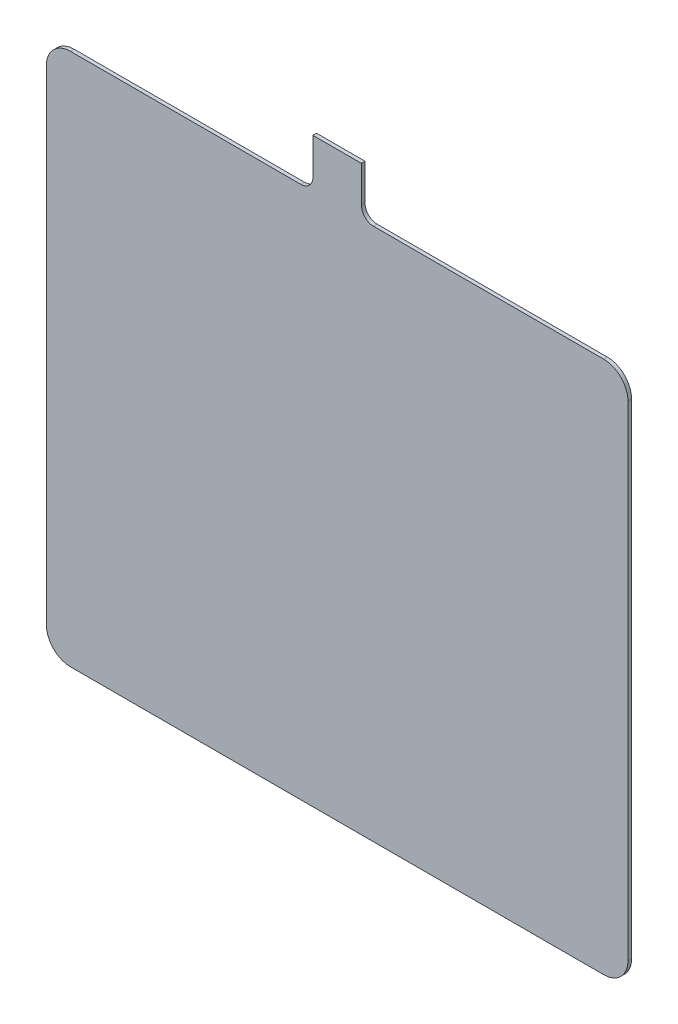
ISO-10303-21;
HEADER;
FILE_DESCRIPTION(('STEP AP214'),'2;1');
FILE_NAME('part.step','',(''),(''),'','','');
FILE_SCHEMA(('AUTOMOTIVE_DESIGN { 1 0 10303 214 1 1 1 1 }'));
ENDSEC;
DATA;
#1=APPLICATION_CONTEXT('core data for automotive mechanical design processes');
#2=APPLICATION_PROTOCOL_DEFINITION('international standard','automotive_design',2000,#1);
#3=PRODUCT_CONTEXT('',#1,'mechanical');
#4=PRODUCT('Part','Part','',(#3));
#5=PRODUCT_RELATED_PRODUCT_CATEGORY('part','',(#4));
#6=PRODUCT_DEFINITION_FORMATION('','',#4);
#7=PRODUCT_DEFINITION_CONTEXT('part definition',#1,'design');
#8=PRODUCT_DEFINITION('design','',#6,#7);
#9=PRODUCT_DEFINITION_SHAPE('','',#8);
#10=(LENGTH_UNIT() NAMED_UNIT(*) SI_UNIT(.MILLI.,.METRE.));
#11=(NAMED_UNIT(*) PLANE_ANGLE_UNIT() SI_UNIT($,.RADIAN.));
#12=(NAMED_UNIT(*) SI_UNIT($,.STERADIAN.) SOLID_ANGLE_UNIT());
#13=UNCERTAINTY_MEASURE_WITH_UNIT(LENGTH_MEASURE(1.E-05),#10,'distance_accuracy_value','');
#14=(GEOMETRIC_REPRESENTATION_CONTEXT(3) GLOBAL_UNCERTAINTY_ASSIGNED_CONTEXT((#13)) GLOBAL_UNIT_ASSIGNED_CONTEXT((#10,
#11,#12)) REPRESENTATION_CONTEXT('',''));
#15=CARTESIAN_POINT('',(0.,0.,0.));
#16=DIRECTION('',(0.,0.,1.));
#17=DIRECTION('',(1.,0.,0.));
#18=AXIS2_PLACEMENT_3D('',#15,#16,#17);
#19=CARTESIAN_POINT('',(-30.,305.,3.));
#20=DIRECTION('',(0.,0.,-1.));
#21=DIRECTION('',(-1.,0.,0.));
#22=AXIS2_PLACEMENT_3D('',#19,#20,#21);
#23=CYLINDRICAL_SURFACE('',#22,10.);
#24=CARTESIAN_POINT('',(-30.,305.,0.));
#25=DIRECTION('',(0.,0.,-1.));
#26=DIRECTION('',(1.,0.,0.));
#27=AXIS2_PLACEMENT_3D('',#24,#25,#26);
#28=CIRCLE('',#27,10.);
#29=CARTESIAN_POINT('',(-20.,305.,0.));
#30=VERTEX_POINT('',#29);
#31=CARTESIAN_POINT('',(-30.,295.,0.));
#32=VERTEX_POINT('',#31);
#33=EDGE_CURVE('E165',#30,#32,#28,.T.);
#34=ORIENTED_EDGE('',*,*,#33,.T.);
#35=DIRECTION('',(0.,0.,-1.));
#36=VECTOR('',#35,1.);
#37=CARTESIAN_POINT('',(-30.,295.,3.));
#38=LINE('',#37,#36);
#39=CARTESIAN_POINT('',(-30.,295.,3.));
#40=VERTEX_POINT('',#39);
#41=EDGE_CURVE('E11',#40,#32,#38,.T.);
#42=ORIENTED_EDGE('',*,*,#41,.F.);
#43=CARTESIAN_POINT('',(-30.,305.,3.));
#44=DIRECTION('',(0.,0.,-1.));
#45=DIRECTION('',(1.,0.,0.));
#46=AXIS2_PLACEMENT_3D('',#43,#44,#45);
#47=CIRCLE('',#46,10.);
#48=CARTESIAN_POINT('',(-20.,305.,3.));
#49=VERTEX_POINT('',#48);
#50=EDGE_CURVE('E191',#49,#40,#47,.T.);
#51=ORIENTED_EDGE('',*,*,#50,.F.);
#52=DIRECTION('',(0.,0.,-1.));
#53=VECTOR('',#52,1.);
#54=CARTESIAN_POINT('',(-20.,305.,3.));
#55=LINE('',#54,#53);
#56=EDGE_CURVE('E161',#49,#30,#55,.T.);
#57=ORIENTED_EDGE('',*,*,#56,.T.);
#58=EDGE_LOOP('',(#34,#42,#51,#57));
#59=FACE_BOUND('',#58,.T.);
#60=ADVANCED_FACE('F33',(#59),#23,.F.);
#61=CARTESIAN_POINT('',(-220.,295.,3.));
#62=DIRECTION('',(0.,-1.,0.));
#63=DIRECTION('',(0.,0.,-1.));
#64=AXIS2_PLACEMENT_3D('',#61,#62,#63);
#65=PLANE('',#64);
#66=DIRECTION('',(-1.,0.,0.));
#67=VECTOR('',#66,1.);
#68=CARTESIAN_POINT('',(-220.,295.,0.));
#69=LINE('',#68,#67);
#70=CARTESIAN_POINT('',(-220.,295.,0.));
#71=VERTEX_POINT('',#70);
#72=EDGE_CURVE('E168',#32,#71,#69,.T.);
#73=ORIENTED_EDGE('',*,*,#72,.T.);
#74=DIRECTION('',(0.,0.,-1.));
#75=VECTOR('',#74,1.);
#76=CARTESIAN_POINT('',(-220.,295.,3.));
#77=LINE('',#76,#75);
#78=CARTESIAN_POINT('',(-220.,295.,3.));
#79=VERTEX_POINT('',#78);
#80=EDGE_CURVE('E41',#79,#71,#77,.T.);
#81=ORIENTED_EDGE('',*,*,#80,.F.);
#82=DIRECTION('',(-1.,0.,0.));
#83=VECTOR('',#82,1.);
#84=CARTESIAN_POINT('',(-220.,295.,3.));
#85=LINE('',#84,#83);
#86=EDGE_CURVE('E110',#40,#79,#85,.T.);
#87=ORIENTED_EDGE('',*,*,#86,.F.);
#88=ORIENTED_EDGE('',*,*,#41,.T.);
#89=EDGE_LOOP('',(#73,#81,#87,#88));
#90=FACE_BOUND('',#89,.T.);
#91=ADVANCED_FACE('F279',(#90),#65,.F.);
#92=CARTESIAN_POINT('',(-220.,275.,3.));
#93=DIRECTION('',(0.,0.,-1.));
#94=DIRECTION('',(-1.,0.,0.));
#95=AXIS2_PLACEMENT_3D('',#92,#93,#94);
#96=CYLINDRICAL_SURFACE('',#95,20.);
#97=CARTESIAN_POINT('',(-220.,275.,0.));
#98=DIRECTION('',(0.,0.,1.));
#99=DIRECTION('',(1.,0.,0.));
#100=AXIS2_PLACEMENT_3D('',#97,#98,#99);
#101=CIRCLE('',#100,20.);
#102=CARTESIAN_POINT('',(-240.,275.,0.));
#103=VERTEX_POINT('',#102);
#104=EDGE_CURVE('E170',#71,#103,#101,.T.);
#105=ORIENTED_EDGE('',*,*,#104,.T.);
#106=DIRECTION('',(0.,0.,-1.));
#107=VECTOR('',#106,1.);
#108=CARTESIAN_POINT('',(-240.,275.,3.));
#109=LINE('',#108,#107);
#110=CARTESIAN_POINT('',(-240.,275.,3.));
#111=VERTEX_POINT('',#110);
#112=EDGE_CURVE('E216',#111,#103,#109,.T.);
#113=ORIENTED_EDGE('',*,*,#112,.F.);
#114=CARTESIAN_POINT('',(-220.,275.,3.));
#115=DIRECTION('',(0.,0.,1.));
#116=DIRECTION('',(1.,0.,0.));
#117=AXIS2_PLACEMENT_3D('',#114,#115,#116);
#118=CIRCLE('',#117,20.);
#119=EDGE_CURVE('E224',#79,#111,#118,.T.);
#120=ORIENTED_EDGE('',*,*,#119,.F.);
#121=ORIENTED_EDGE('',*,*,#80,.T.);
#122=EDGE_LOOP('',(#105,#113,#120,#121));
#123=FACE_BOUND('',#122,.T.);
#124=ADVANCED_FACE('F222',(#123),#96,.T.);
#125=CARTESIAN_POINT('',(-240.,275.,3.));
#126=DIRECTION('',(1.,0.,0.));
#127=DIRECTION('',(0.,1.,0.));
#128=AXIS2_PLACEMENT_3D('',#125,#126,#127);
#129=PLANE('',#128);
#130=DIRECTION('',(0.,-1.,0.));
#131=VECTOR('',#130,1.);
#132=CARTESIAN_POINT('',(-240.,275.,0.));
#133=LINE('',#132,#131);
#134=CARTESIAN_POINT('',(-240.,-125.,0.));
#135=VERTEX_POINT('',#134);
#136=EDGE_CURVE('E172',#103,#135,#133,.T.);
#137=ORIENTED_EDGE('',*,*,#136,.T.);
#138=DIRECTION('',(0.,0.,-1.));
#139=VECTOR('',#138,1.);
#140=CARTESIAN_POINT('',(-240.,-125.,3.));
#141=LINE('',#140,#139);
#142=CARTESIAN_POINT('',(-240.,-125.,3.));
#143=VERTEX_POINT('',#142);
#144=EDGE_CURVE('E213',#143,#135,#141,.T.);
#145=ORIENTED_EDGE('',*,*,#144,.F.);
#146=DIRECTION('',(0.,-1.,0.));
#147=VECTOR('',#146,1.);
#148=CARTESIAN_POINT('',(-240.,275.,3.));
#149=LINE('',#148,#147);
#150=EDGE_CURVE('E242',#111,#143,#149,.T.);
#151=ORIENTED_EDGE('',*,*,#150,.F.);
#152=ORIENTED_EDGE('',*,*,#112,.T.);
#153=EDGE_LOOP('',(#137,#145,#151,#152));
#154=FACE_BOUND('',#153,.T.);
#155=ADVANCED_FACE('F233',(#154),#129,.F.);
#156=CARTESIAN_POINT('',(-220.,-125.,3.));
#157=DIRECTION('',(0.,0.,-1.));
#158=DIRECTION('',(-1.,0.,0.));
#159=AXIS2_PLACEMENT_3D('',#156,#157,#158);
#160=CYLINDRICAL_SURFACE('',#159,20.);
#161=CARTESIAN_POINT('',(-220.,-125.,0.));
#162=DIRECTION('',(0.,0.,1.));
#163=DIRECTION('',(1.,0.,0.));
#164=AXIS2_PLACEMENT_3D('',#161,#162,#163);
#165=CIRCLE('',#164,20.);
#166=CARTESIAN_POINT('',(-220.,-145.,0.));
#167=VERTEX_POINT('',#166);
#168=EDGE_CURVE('E174',#135,#167,#165,.T.);
#169=ORIENTED_EDGE('',*,*,#168,.T.);
#170=DIRECTION('',(0.,0.,-1.));
#171=VECTOR('',#170,1.);
#172=CARTESIAN_POINT('',(-220.,-145.,3.));
#173=LINE('',#172,#171);
#174=CARTESIAN_POINT('',(-220.,-145.,3.));
#175=VERTEX_POINT('',#174);
#176=EDGE_CURVE('E210',#175,#167,#173,.T.);
#177=ORIENTED_EDGE('',*,*,#176,.F.);
#178=CARTESIAN_POINT('',(-220.,-125.,3.));
#179=DIRECTION('',(0.,0.,1.));
#180=DIRECTION('',(1.,0.,0.));
#181=AXIS2_PLACEMENT_3D('',#178,#179,#180);
#182=CIRCLE('',#181,20.);
#183=EDGE_CURVE('E239',#143,#175,#182,.T.);
#184=ORIENTED_EDGE('',*,*,#183,.F.);
#185=ORIENTED_EDGE('',*,*,#144,.T.);
#186=EDGE_LOOP('',(#169,#177,#184,#185));
#187=FACE_BOUND('',#186,.T.);
#188=ADVANCED_FACE('F237',(#187),#160,.T.);
#189=CARTESIAN_POINT('',(-220.,-145.,3.));
#190=DIRECTION('',(0.,1.,0.));
#191=DIRECTION('',(0.,0.,1.));
#192=AXIS2_PLACEMENT_3D('',#189,#190,#191);
#193=PLANE('',#192);
#194=DIRECTION('',(1.,0.,0.));
#195=VECTOR('',#194,1.);
#196=CARTESIAN_POINT('',(-220.,-145.,0.));
#197=LINE('',#196,#195);
#198=CARTESIAN_POINT('',(220.,-145.,0.));
#199=VERTEX_POINT('',#198);
#200=EDGE_CURVE('E176',#167,#199,#197,.T.);
#201=ORIENTED_EDGE('',*,*,#200,.T.);
#202=DIRECTION('',(0.,0.,-1.));
#203=VECTOR('',#202,1.);
#204=CARTESIAN_POINT('',(220.,-145.,3.));
#205=LINE('',#204,#203);
#206=CARTESIAN_POINT('',(220.,-145.,3.));
#207=VERTEX_POINT('',#206);
#208=EDGE_CURVE('E207',#207,#199,#205,.T.);
#209=ORIENTED_EDGE('',*,*,#208,.F.);
#210=DIRECTION('',(1.,0.,0.));
#211=VECTOR('',#210,1.);
#212=CARTESIAN_POINT('',(-220.,-145.,3.));
#213=LINE('',#212,#211);
#214=EDGE_CURVE('E241',#175,#207,#213,.T.);
#215=ORIENTED_EDGE('',*,*,#214,.F.);
#216=ORIENTED_EDGE('',*,*,#176,.T.);
#217=EDGE_LOOP('',(#201,#209,#215,#216));
#218=FACE_BOUND('',#217,.T.);
#219=ADVANCED_FACE('F292',(#218),#193,.F.);
#220=CARTESIAN_POINT('',(220.,-125.,3.));
#221=DIRECTION('',(0.,0.,-1.));
#222=DIRECTION('',(-1.,0.,0.));
#223=AXIS2_PLACEMENT_3D('',#220,#221,#222);
#224=CYLINDRICAL_SURFACE('',#223,20.);
#225=CARTESIAN_POINT('',(220.,-125.,0.));
#226=DIRECTION('',(0.,0.,1.));
#227=DIRECTION('',(1.,0.,0.));
#228=AXIS2_PLACEMENT_3D('',#225,#226,#227);
#229=CIRCLE('',#228,20.);
#230=CARTESIAN_POINT('',(240.,-125.,0.));
#231=VERTEX_POINT('',#230);
#232=EDGE_CURVE('E178',#199,#231,#229,.T.);
#233=ORIENTED_EDGE('',*,*,#232,.T.);
#234=DIRECTION('',(0.,0.,-1.));
#235=VECTOR('',#234,1.);
#236=CARTESIAN_POINT('',(240.,-125.,3.));
#237=LINE('',#236,#235);
#238=CARTESIAN_POINT('',(240.,-125.,3.));
#239=VERTEX_POINT('',#238);
#240=EDGE_CURVE('E204',#239,#231,#237,.T.);
#241=ORIENTED_EDGE('',*,*,#240,.F.);
#242=CARTESIAN_POINT('',(220.,-125.,3.));
#243=DIRECTION('',(0.,0.,1.));
#244=DIRECTION('',(1.,0.,0.));
#245=AXIS2_PLACEMENT_3D('',#242,#243,#244);
#246=CIRCLE('',#245,20.);
#247=EDGE_CURVE('E244',#207,#239,#246,.T.);
#248=ORIENTED_EDGE('',*,*,#247,.F.);
#249=ORIENTED_EDGE('',*,*,#208,.T.);
#250=EDGE_LOOP('',(#233,#241,#248,#249));
#251=FACE_BOUND('',#250,.T.);
#252=ADVANCED_FACE('F295',(#251),#224,.T.);
#253=CARTESIAN_POINT('',(240.,275.,3.));
#254=DIRECTION('',(-1.,0.,0.));
#255=DIRECTION('',(0.,-1.,0.));
#256=AXIS2_PLACEMENT_3D('',#253,#254,#255);
#257=PLANE('',#256);
#258=DIRECTION('',(0.,1.,0.));
#259=VECTOR('',#258,1.);
#260=CARTESIAN_POINT('',(240.,275.,0.));
#261=LINE('',#260,#259);
#262=CARTESIAN_POINT('',(240.,275.,0.));
#263=VERTEX_POINT('',#262);
#264=EDGE_CURVE('E180',#231,#263,#261,.T.);
#265=ORIENTED_EDGE('',*,*,#264,.T.);
#266=DIRECTION('',(0.,0.,-1.));
#267=VECTOR('',#266,1.);
#268=CARTESIAN_POINT('',(240.,275.,3.));
#269=LINE('',#268,#267);
#270=CARTESIAN_POINT('',(240.,275.,3.));
#271=VERTEX_POINT('',#270);
#272=EDGE_CURVE('E201',#271,#263,#269,.T.);
#273=ORIENTED_EDGE('',*,*,#272,.F.);
#274=DIRECTION('',(0.,1.,0.));
#275=VECTOR('',#274,1.);
#276=CARTESIAN_POINT('',(240.,275.,3.));
#277=LINE('',#276,#275);
#278=EDGE_CURVE('E250',#239,#271,#277,.T.);
#279=ORIENTED_EDGE('',*,*,#278,.F.);
#280=ORIENTED_EDGE('',*,*,#240,.T.);
#281=EDGE_LOOP('',(#265,#273,#279,#280));
#282=FACE_BOUND('',#281,.T.);
#283=ADVANCED_FACE('F299',(#282),#257,.F.);
#284=CARTESIAN_POINT('',(220.,275.,3.));
#285=DIRECTION('',(0.,0.,-1.));
#286=DIRECTION('',(-1.,0.,0.));
#287=AXIS2_PLACEMENT_3D('',#284,#285,#286);
#288=CYLINDRICAL_SURFACE('',#287,20.);
#289=CARTESIAN_POINT('',(220.,275.,0.));
#290=DIRECTION('',(0.,0.,1.));
#291=DIRECTION('',(-1.,0.,0.));
#292=AXIS2_PLACEMENT_3D('',#289,#290,#291);
#293=CIRCLE('',#292,20.);
#294=CARTESIAN_POINT('',(220.,295.,0.));
#295=VERTEX_POINT('',#294);
#296=EDGE_CURVE('E182',#263,#295,#293,.T.);
#297=ORIENTED_EDGE('',*,*,#296,.T.);
#298=DIRECTION('',(0.,0.,-1.));
#299=VECTOR('',#298,1.);
#300=CARTESIAN_POINT('',(220.,295.,3.));
#301=LINE('',#300,#299);
#302=CARTESIAN_POINT('',(220.,295.,3.));
#303=VERTEX_POINT('',#302);
#304=EDGE_CURVE('E198',#303,#295,#301,.T.);
#305=ORIENTED_EDGE('',*,*,#304,.F.);
#306=CARTESIAN_POINT('',(220.,275.,3.));
#307=DIRECTION('',(0.,0.,1.));
#308=DIRECTION('',(-1.,0.,0.));
#309=AXIS2_PLACEMENT_3D('',#306,#307,#308);
#310=CIRCLE('',#309,20.);
#311=EDGE_CURVE('E252',#271,#303,#310,.T.);
#312=ORIENTED_EDGE('',*,*,#311,.F.);
#313=ORIENTED_EDGE('',*,*,#272,.T.);
#314=EDGE_LOOP('',(#297,#305,#312,#313));
#315=FACE_BOUND('',#314,.T.);
#316=ADVANCED_FACE('F303',(#315),#288,.T.);
#317=CARTESIAN_POINT('',(30.0000000000001,295.,3.));
#318=DIRECTION('',(0.,-1.,0.));
#319=DIRECTION('',(0.,0.,-1.));
#320=AXIS2_PLACEMENT_3D('',#317,#318,#319);
#321=PLANE('',#320);
#322=DIRECTION('',(-1.,0.,0.));
#323=VECTOR('',#322,1.);
#324=CARTESIAN_POINT('',(30.0000000000001,295.,0.));
#325=LINE('',#324,#323);
#326=CARTESIAN_POINT('',(30.0000000000001,295.,0.));
#327=VERTEX_POINT('',#326);
#328=EDGE_CURVE('E184',#295,#327,#325,.T.);
#329=ORIENTED_EDGE('',*,*,#328,.T.);
#330=DIRECTION('',(0.,0.,-1.));
#331=VECTOR('',#330,1.);
#332=CARTESIAN_POINT('',(30.0000000000001,295.,3.));
#333=LINE('',#332,#331);
#334=CARTESIAN_POINT('',(30.0000000000001,295.,3.));
#335=VERTEX_POINT('',#334);
#336=EDGE_CURVE('E195',#335,#327,#333,.T.);
#337=ORIENTED_EDGE('',*,*,#336,.F.);
#338=DIRECTION('',(-1.,0.,0.));
#339=VECTOR('',#338,1.);
#340=CARTESIAN_POINT('',(30.0000000000001,295.,3.));
#341=LINE('',#340,#339);
#342=EDGE_CURVE('E254',#303,#335,#341,.T.);
#343=ORIENTED_EDGE('',*,*,#342,.F.);
#344=ORIENTED_EDGE('',*,*,#304,.T.);
#345=EDGE_LOOP('',(#329,#337,#343,#344));
#346=FACE_BOUND('',#345,.T.);
#347=ADVANCED_FACE('F260',(#346),#321,.F.);
#348=CARTESIAN_POINT('',(30.,305.,3.));
#349=DIRECTION('',(0.,0.,-1.));
#350=DIRECTION('',(-1.,0.,0.));
#351=AXIS2_PLACEMENT_3D('',#348,#349,#350);
#352=CYLINDRICAL_SURFACE('',#351,10.);
#353=CARTESIAN_POINT('',(30.,305.,0.));
#354=DIRECTION('',(0.,0.,-1.));
#355=DIRECTION('',(-1.,0.,0.));
#356=AXIS2_PLACEMENT_3D('',#353,#354,#355);
#357=CIRCLE('',#356,10.);
#358=CARTESIAN_POINT('',(20.,305.,0.));
#359=VERTEX_POINT('',#358);
#360=EDGE_CURVE('E186',#327,#359,#357,.T.);
#361=ORIENTED_EDGE('',*,*,#360,.T.);
#362=DIRECTION('',(0.,0.,-1.));
#363=VECTOR('',#362,1.);
#364=CARTESIAN_POINT('',(20.,305.,3.));
#365=LINE('',#364,#363);
#366=CARTESIAN_POINT('',(20.,305.,3.));
#367=VERTEX_POINT('',#366);
#368=EDGE_CURVE('E156',#367,#359,#365,.T.);
#369=ORIENTED_EDGE('',*,*,#368,.F.);
#370=CARTESIAN_POINT('',(30.,305.,3.));
#371=DIRECTION('',(0.,0.,-1.));
#372=DIRECTION('',(-1.,0.,0.));
#373=AXIS2_PLACEMENT_3D('',#370,#371,#372);
#374=CIRCLE('',#373,10.);
#375=EDGE_CURVE('E147',#335,#367,#374,.T.);
#376=ORIENTED_EDGE('',*,*,#375,.F.);
#377=ORIENTED_EDGE('',*,*,#336,.T.);
#378=EDGE_LOOP('',(#361,#369,#376,#377));
#379=FACE_BOUND('',#378,.T.);
#380=ADVANCED_FACE('F264',(#379),#352,.F.);
#381=CARTESIAN_POINT('',(20.,305.,3.));
#382=DIRECTION('',(-1.,0.,0.));
#383=DIRECTION('',(0.,-1.,0.));
#384=AXIS2_PLACEMENT_3D('',#381,#382,#383);
#385=PLANE('',#384);
#386=DIRECTION('',(0.,1.,0.));
#387=VECTOR('',#386,1.);
#388=CARTESIAN_POINT('',(20.,305.,0.));
#389=LINE('',#388,#387);
#390=CARTESIAN_POINT('',(20.,335.,0.));
#391=VERTEX_POINT('',#390);
#392=EDGE_CURVE('E155',#359,#391,#389,.T.);
#393=ORIENTED_EDGE('',*,*,#392,.T.);
#394=DIRECTION('',(0.,0.,-1.));
#395=VECTOR('',#394,1.);
#396=CARTESIAN_POINT('',(20.,335.,3.));
#397=LINE('',#396,#395);
#398=CARTESIAN_POINT('',(20.,335.,3.));
#399=VERTEX_POINT('',#398);
#400=EDGE_CURVE('E152',#399,#391,#397,.T.);
#401=ORIENTED_EDGE('',*,*,#400,.F.);
#402=DIRECTION('',(0.,1.,0.));
#403=VECTOR('',#402,1.);
#404=CARTESIAN_POINT('',(20.,305.,3.));
#405=LINE('',#404,#403);
#406=EDGE_CURVE('E141',#367,#399,#405,.T.);
#407=ORIENTED_EDGE('',*,*,#406,.F.);
#408=ORIENTED_EDGE('',*,*,#368,.T.);
#409=EDGE_LOOP('',(#393,#401,#407,#408));
#410=FACE_BOUND('',#409,.T.);
#411=ADVANCED_FACE('F153',(#410),#385,.F.);
#412=CARTESIAN_POINT('',(-20.,335.,3.));
#413=DIRECTION('',(0.,-1.,0.));
#414=DIRECTION('',(1.,0.,0.));
#415=AXIS2_PLACEMENT_3D('',#412,#413,#414);
#416=PLANE('',#415);
#417=DIRECTION('',(-1.,0.,0.));
#418=VECTOR('',#417,1.);
#419=CARTESIAN_POINT('',(-20.,335.,0.));
#420=LINE('',#419,#418);
#421=CARTESIAN_POINT('',(-20.,335.,0.));
#422=VERTEX_POINT('',#421);
#423=EDGE_CURVE('E96',#391,#422,#420,.T.);
#424=ORIENTED_EDGE('',*,*,#423,.T.);
#425=DIRECTION('',(0.,0.,-1.));
#426=VECTOR('',#425,1.);
#427=CARTESIAN_POINT('',(-20.,335.,3.));
#428=LINE('',#427,#426);
#429=CARTESIAN_POINT('',(-20.,335.,3.));
#430=VERTEX_POINT('',#429);
#431=EDGE_CURVE('E157',#430,#422,#428,.T.);
#432=ORIENTED_EDGE('',*,*,#431,.F.);
#433=DIRECTION('',(-1.,0.,0.));
#434=VECTOR('',#433,1.);
#435=CARTESIAN_POINT('',(-20.,335.,3.));
#436=LINE('',#435,#434);
#437=EDGE_CURVE('E145',#399,#430,#436,.T.);
#438=ORIENTED_EDGE('',*,*,#437,.F.);
#439=ORIENTED_EDGE('',*,*,#400,.T.);
#440=EDGE_LOOP('',(#424,#432,#438,#439));
#441=FACE_BOUND('',#440,.T.);
#442=ADVANCED_FACE('F159',(#441),#416,.F.);
#443=CARTESIAN_POINT('',(-20.,305.,3.));
#444=DIRECTION('',(1.,0.,0.));
#445=DIRECTION('',(0.,1.,0.));
#446=AXIS2_PLACEMENT_3D('',#443,#444,#445);
#447=PLANE('',#446);
#448=DIRECTION('',(0.,-1.,0.));
#449=VECTOR('',#448,1.);
#450=CARTESIAN_POINT('',(-20.,305.,0.));
#451=LINE('',#450,#449);
#452=EDGE_CURVE('E102',#422,#30,#451,.T.);
#453=ORIENTED_EDGE('',*,*,#452,.T.);
#454=ORIENTED_EDGE('',*,*,#56,.F.);
#455=DIRECTION('',(0.,-1.,0.));
#456=VECTOR('',#455,1.);
#457=CARTESIAN_POINT('',(-20.,305.,3.));
#458=LINE('',#457,#456);
#459=EDGE_CURVE('E49',#430,#49,#458,.T.);
#460=ORIENTED_EDGE('',*,*,#459,.F.);
#461=ORIENTED_EDGE('',*,*,#431,.T.);
#462=EDGE_LOOP('',(#453,#454,#460,#461));
#463=FACE_BOUND('',#462,.T.);
#464=ADVANCED_FACE('F268',(#463),#447,.F.);
#465=CARTESIAN_POINT('',(-30.,305.,3.));
#466=DIRECTION('',(0.,0.,1.));
#467=DIRECTION('',(1.,0.,0.));
#468=AXIS2_PLACEMENT_3D('',#465,#466,#467);
#469=PLANE('',#468);
#470=ORIENTED_EDGE('',*,*,#50,.T.);
#471=ORIENTED_EDGE('',*,*,#86,.T.);
#472=ORIENTED_EDGE('',*,*,#119,.T.);
#473=ORIENTED_EDGE('',*,*,#150,.T.);
#474=ORIENTED_EDGE('',*,*,#183,.T.);
#475=ORIENTED_EDGE('',*,*,#214,.T.);
#476=ORIENTED_EDGE('',*,*,#247,.T.);
#477=ORIENTED_EDGE('',*,*,#278,.T.);
#478=ORIENTED_EDGE('',*,*,#311,.T.);
#479=ORIENTED_EDGE('',*,*,#342,.T.);
#480=ORIENTED_EDGE('',*,*,#375,.T.);
#481=ORIENTED_EDGE('',*,*,#406,.T.);
#482=ORIENTED_EDGE('',*,*,#437,.T.);
#483=ORIENTED_EDGE('',*,*,#459,.T.);
#484=EDGE_LOOP('',(#470,#471,#472,#473,#474,#475,#476,#477,#478,#479,#480,#481,#482,#483));
#485=FACE_BOUND('',#484,.T.);
#486=ADVANCED_FACE('F143',(#485),#469,.T.);
#487=CARTESIAN_POINT('',(-30.,305.,0.));
#488=DIRECTION('',(0.,0.,1.));
#489=DIRECTION('',(1.,0.,0.));
#490=AXIS2_PLACEMENT_3D('',#487,#488,#489);
#491=PLANE('',#490);
#492=ORIENTED_EDGE('',*,*,#33,.F.);
#493=ORIENTED_EDGE('',*,*,#452,.F.);
#494=ORIENTED_EDGE('',*,*,#423,.F.);
#495=ORIENTED_EDGE('',*,*,#392,.F.);
#496=ORIENTED_EDGE('',*,*,#360,.F.);
#497=ORIENTED_EDGE('',*,*,#328,.F.);
#498=ORIENTED_EDGE('',*,*,#296,.F.);
#499=ORIENTED_EDGE('',*,*,#264,.F.);
#500=ORIENTED_EDGE('',*,*,#232,.F.);
#501=ORIENTED_EDGE('',*,*,#200,.F.);
#502=ORIENTED_EDGE('',*,*,#168,.F.);
#503=ORIENTED_EDGE('',*,*,#136,.F.);
#504=ORIENTED_EDGE('',*,*,#104,.F.);
#505=ORIENTED_EDGE('',*,*,#72,.F.);
#506=EDGE_LOOP('',(#492,#493,#494,#495,#496,#497,#498,#499,#500,#501,#502,#503,#504,#505));
#507=FACE_BOUND('',#506,.T.);
#508=ADVANCED_FACE('F228',(#507),#491,.F.);
#509=CLOSED_SHELL('',(#60,#91,#124,#155,#188,#219,#252,#283,#316,#347,#380,#411,#442,#464,#486,#508));
#510=MANIFOLD_SOLID_BREP('B2',#509);
#511=ADVANCED_BREP_SHAPE_REPRESENTATION('',(#18,#510),#14);
#512=SHAPE_DEFINITION_REPRESENTATION(#9,#511);
ENDSEC;
END-ISO-10303-21;
